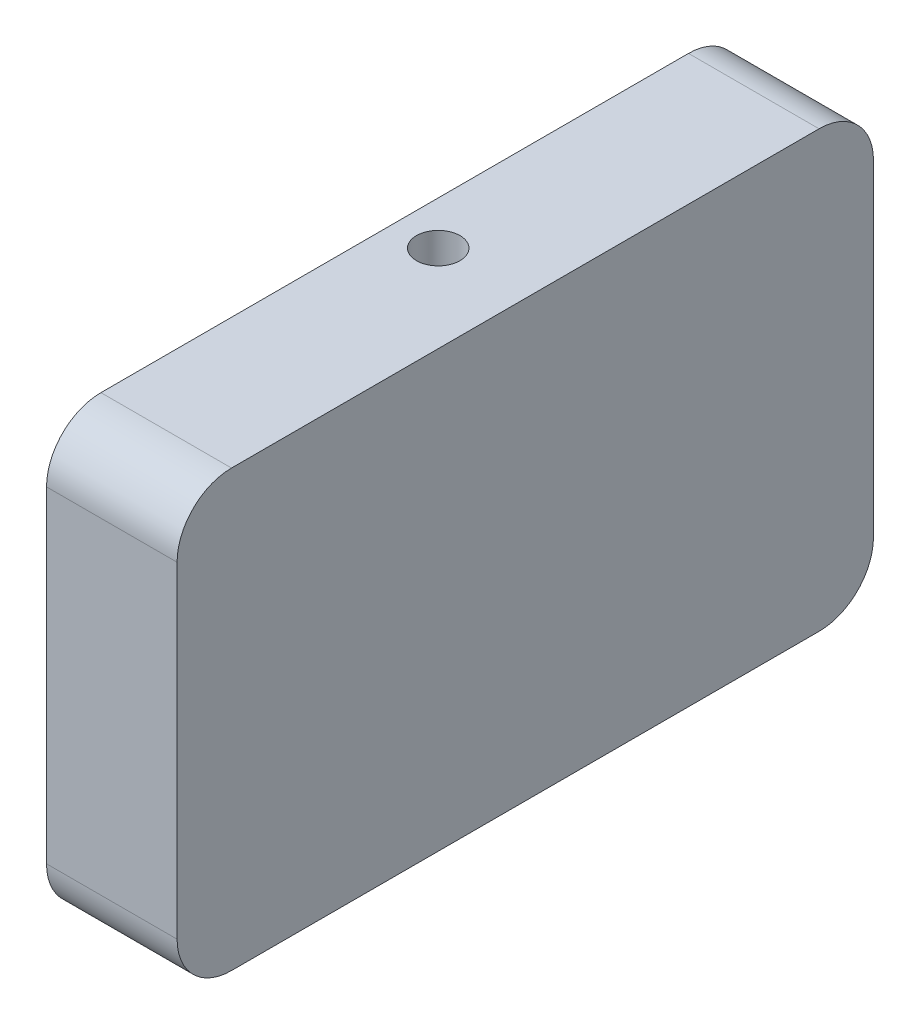
ISO-10303-21;
HEADER;
FILE_DESCRIPTION(('STEP AP214'),'2;1');
FILE_NAME('part.step','',(''),(''),'','','');
FILE_SCHEMA(('AUTOMOTIVE_DESIGN { 1 0 10303 214 1 1 1 1 }'));
ENDSEC;
DATA;
#1=APPLICATION_CONTEXT('core data for automotive mechanical design processes');
#2=APPLICATION_PROTOCOL_DEFINITION('international standard','automotive_design',2000,#1);
#3=PRODUCT_CONTEXT('',#1,'mechanical');
#4=PRODUCT('Part','Part','',(#3));
#5=PRODUCT_RELATED_PRODUCT_CATEGORY('part','',(#4));
#6=PRODUCT_DEFINITION_FORMATION('','',#4);
#7=PRODUCT_DEFINITION_CONTEXT('part definition',#1,'design');
#8=PRODUCT_DEFINITION('design','',#6,#7);
#9=PRODUCT_DEFINITION_SHAPE('','',#8);
#10=(LENGTH_UNIT() NAMED_UNIT(*) SI_UNIT(.MILLI.,.METRE.));
#11=(NAMED_UNIT(*) PLANE_ANGLE_UNIT() SI_UNIT($,.RADIAN.));
#12=(NAMED_UNIT(*) SI_UNIT($,.STERADIAN.) SOLID_ANGLE_UNIT());
#13=UNCERTAINTY_MEASURE_WITH_UNIT(LENGTH_MEASURE(1.E-05),#10,'distance_accuracy_value','');
#14=(GEOMETRIC_REPRESENTATION_CONTEXT(3) GLOBAL_UNCERTAINTY_ASSIGNED_CONTEXT((#13)) GLOBAL_UNIT_ASSIGNED_CONTEXT((#10,
#11,#12)) REPRESENTATION_CONTEXT('',''));
#15=CARTESIAN_POINT('',(0.,0.,0.));
#16=DIRECTION('',(0.,0.,1.));
#17=DIRECTION('',(1.,0.,0.));
#18=AXIS2_PLACEMENT_3D('',#15,#16,#17);
#19=CARTESIAN_POINT('',(12.,15.,-27.));
#20=DIRECTION('',(-1.,0.,0.));
#21=DIRECTION('',(0.,0.,1.));
#22=AXIS2_PLACEMENT_3D('',#19,#20,#21);
#23=CYLINDRICAL_SURFACE('',#22,5.00000000000001);
#24=CARTESIAN_POINT('',(0.,15.,-27.));
#25=DIRECTION('',(1.,0.,0.));
#26=DIRECTION('',(0.,0.,1.));
#27=AXIS2_PLACEMENT_3D('',#24,#25,#26);
#28=CIRCLE('',#27,5.00000000000001);
#29=CARTESIAN_POINT('',(0.,15.,-32.));
#30=VERTEX_POINT('',#29);
#31=CARTESIAN_POINT('',(0.,20.,-27.));
#32=VERTEX_POINT('',#31);
#33=EDGE_CURVE('E137',#30,#32,#28,.T.);
#34=ORIENTED_EDGE('',*,*,#33,.T.);
#35=DIRECTION('',(-1.,0.,0.));
#36=VECTOR('',#35,1.);
#37=CARTESIAN_POINT('',(12.,20.,-27.));
#38=LINE('',#37,#36);
#39=CARTESIAN_POINT('',(12.,20.,-27.));
#40=VERTEX_POINT('',#39);
#41=EDGE_CURVE('E11',#40,#32,#38,.T.);
#42=ORIENTED_EDGE('',*,*,#41,.F.);
#43=CARTESIAN_POINT('',(12.,15.,-27.));
#44=DIRECTION('',(1.,0.,0.));
#45=DIRECTION('',(0.,0.,1.));
#46=AXIS2_PLACEMENT_3D('',#43,#44,#45);
#47=CIRCLE('',#46,5.00000000000001);
#48=CARTESIAN_POINT('',(12.,15.,-32.));
#49=VERTEX_POINT('',#48);
#50=EDGE_CURVE('E152',#49,#40,#47,.T.);
#51=ORIENTED_EDGE('',*,*,#50,.F.);
#52=DIRECTION('',(-1.,0.,0.));
#53=VECTOR('',#52,1.);
#54=CARTESIAN_POINT('',(12.,15.,-32.));
#55=LINE('',#54,#53);
#56=EDGE_CURVE('E133',#49,#30,#55,.T.);
#57=ORIENTED_EDGE('',*,*,#56,.T.);
#58=EDGE_LOOP('',(#34,#42,#51,#57));
#59=FACE_BOUND('',#58,.T.);
#60=ADVANCED_FACE('F35',(#59),#23,.T.);
#61=CARTESIAN_POINT('',(12.,20.,27.));
#62=DIRECTION('',(0.,-1.,0.));
#63=DIRECTION('',(0.,0.,-1.));
#64=AXIS2_PLACEMENT_3D('',#61,#62,#63);
#65=PLANE('',#64);
#66=CARTESIAN_POINT('',(4.,20.,0.));
#67=DIRECTION('',(0.,-1.,0.));
#68=DIRECTION('',(0.,0.,-1.));
#69=AXIS2_PLACEMENT_3D('',#66,#67,#68);
#70=CIRCLE('',#69,2.);
#71=CARTESIAN_POINT('',(4.,20.,-2.));
#72=VERTEX_POINT('',#71);
#73=EDGE_CURVE('E167',#72,#72,#70,.T.);
#74=ORIENTED_EDGE('',*,*,#73,.T.);
#75=EDGE_LOOP('',(#74));
#76=FACE_BOUND('',#75,.T.);
#77=DIRECTION('',(0.,0.,1.));
#78=VECTOR('',#77,1.);
#79=CARTESIAN_POINT('',(0.,20.,27.));
#80=LINE('',#79,#78);
#81=CARTESIAN_POINT('',(0.,20.,27.));
#82=VERTEX_POINT('',#81);
#83=EDGE_CURVE('E140',#32,#82,#80,.T.);
#84=ORIENTED_EDGE('',*,*,#83,.T.);
#85=DIRECTION('',(-1.,0.,0.));
#86=VECTOR('',#85,1.);
#87=CARTESIAN_POINT('',(12.,20.,27.));
#88=LINE('',#87,#86);
#89=CARTESIAN_POINT('',(12.,20.,27.));
#90=VERTEX_POINT('',#89);
#91=EDGE_CURVE('E48',#90,#82,#88,.T.);
#92=ORIENTED_EDGE('',*,*,#91,.F.);
#93=DIRECTION('',(0.,0.,1.));
#94=VECTOR('',#93,1.);
#95=CARTESIAN_POINT('',(12.,20.,27.));
#96=LINE('',#95,#94);
#97=EDGE_CURVE('E100',#40,#90,#96,.T.);
#98=ORIENTED_EDGE('',*,*,#97,.F.);
#99=ORIENTED_EDGE('',*,*,#41,.T.);
#100=EDGE_LOOP('',(#84,#92,#98,#99));
#101=FACE_BOUND('',#100,.T.);
#102=ADVANCED_FACE('F190',(#76,#101),#65,.F.);
#103=CARTESIAN_POINT('',(12.,15.,27.));
#104=DIRECTION('',(-1.,0.,0.));
#105=DIRECTION('',(0.,0.,1.));
#106=AXIS2_PLACEMENT_3D('',#103,#104,#105);
#107=CYLINDRICAL_SURFACE('',#106,5.);
#108=CARTESIAN_POINT('',(0.,15.,27.));
#109=DIRECTION('',(1.,0.,0.));
#110=DIRECTION('',(0.,0.,1.));
#111=AXIS2_PLACEMENT_3D('',#108,#109,#110);
#112=CIRCLE('',#111,5.);
#113=CARTESIAN_POINT('',(0.,15.,32.));
#114=VERTEX_POINT('',#113);
#115=EDGE_CURVE('E143',#82,#114,#112,.T.);
#116=ORIENTED_EDGE('',*,*,#115,.T.);
#117=DIRECTION('',(-1.,0.,0.));
#118=VECTOR('',#117,1.);
#119=CARTESIAN_POINT('',(12.,15.,32.));
#120=LINE('',#119,#118);
#121=CARTESIAN_POINT('',(12.,15.,32.));
#122=VERTEX_POINT('',#121);
#123=EDGE_CURVE('E159',#122,#114,#120,.T.);
#124=ORIENTED_EDGE('',*,*,#123,.F.);
#125=CARTESIAN_POINT('',(12.,15.,27.));
#126=DIRECTION('',(1.,0.,0.));
#127=DIRECTION('',(0.,0.,1.));
#128=AXIS2_PLACEMENT_3D('',#125,#126,#127);
#129=CIRCLE('',#128,5.);
#130=EDGE_CURVE('E206',#90,#122,#129,.T.);
#131=ORIENTED_EDGE('',*,*,#130,.F.);
#132=ORIENTED_EDGE('',*,*,#91,.T.);
#133=EDGE_LOOP('',(#116,#124,#131,#132));
#134=FACE_BOUND('',#133,.T.);
#135=ADVANCED_FACE('F195',(#134),#107,.T.);
#136=CARTESIAN_POINT('',(12.,15.,32.));
#137=DIRECTION('',(0.,0.,-1.));
#138=DIRECTION('',(-1.,0.,0.));
#139=AXIS2_PLACEMENT_3D('',#136,#137,#138);
#140=PLANE('',#139);
#141=DIRECTION('',(0.,-1.,0.));
#142=VECTOR('',#141,1.);
#143=CARTESIAN_POINT('',(0.,15.,32.));
#144=LINE('',#143,#142);
#145=CARTESIAN_POINT('',(0.,-15.,32.));
#146=VERTEX_POINT('',#145);
#147=EDGE_CURVE('E145',#114,#146,#144,.T.);
#148=ORIENTED_EDGE('',*,*,#147,.T.);
#149=DIRECTION('',(-1.,0.,0.));
#150=VECTOR('',#149,1.);
#151=CARTESIAN_POINT('',(12.,-15.,32.));
#152=LINE('',#151,#150);
#153=CARTESIAN_POINT('',(12.,-15.,32.));
#154=VERTEX_POINT('',#153);
#155=EDGE_CURVE('E156',#154,#146,#152,.T.);
#156=ORIENTED_EDGE('',*,*,#155,.F.);
#157=DIRECTION('',(0.,-1.,0.));
#158=VECTOR('',#157,1.);
#159=CARTESIAN_POINT('',(12.,15.,32.));
#160=LINE('',#159,#158);
#161=EDGE_CURVE('E208',#122,#154,#160,.T.);
#162=ORIENTED_EDGE('',*,*,#161,.F.);
#163=ORIENTED_EDGE('',*,*,#123,.T.);
#164=EDGE_LOOP('',(#148,#156,#162,#163));
#165=FACE_BOUND('',#164,.T.);
#166=ADVANCED_FACE('F250',(#165),#140,.F.);
#167=CARTESIAN_POINT('',(12.,-15.,27.));
#168=DIRECTION('',(-1.,0.,0.));
#169=DIRECTION('',(0.,0.,1.));
#170=AXIS2_PLACEMENT_3D('',#167,#168,#169);
#171=CYLINDRICAL_SURFACE('',#170,5.);
#172=CARTESIAN_POINT('',(0.,-15.,27.));
#173=DIRECTION('',(1.,0.,0.));
#174=DIRECTION('',(0.,0.,1.));
#175=AXIS2_PLACEMENT_3D('',#172,#173,#174);
#176=CIRCLE('',#175,5.);
#177=CARTESIAN_POINT('',(0.,-20.,27.));
#178=VERTEX_POINT('',#177);
#179=EDGE_CURVE('E147',#146,#178,#176,.T.);
#180=ORIENTED_EDGE('',*,*,#179,.T.);
#181=DIRECTION('',(-1.,0.,0.));
#182=VECTOR('',#181,1.);
#183=CARTESIAN_POINT('',(12.,-20.,27.));
#184=LINE('',#183,#182);
#185=CARTESIAN_POINT('',(12.,-20.,27.));
#186=VERTEX_POINT('',#185);
#187=EDGE_CURVE('E128',#186,#178,#184,.T.);
#188=ORIENTED_EDGE('',*,*,#187,.F.);
#189=CARTESIAN_POINT('',(12.,-15.,27.));
#190=DIRECTION('',(1.,0.,0.));
#191=DIRECTION('',(0.,0.,1.));
#192=AXIS2_PLACEMENT_3D('',#189,#190,#191);
#193=CIRCLE('',#192,5.);
#194=EDGE_CURVE('E119',#154,#186,#193,.T.);
#195=ORIENTED_EDGE('',*,*,#194,.F.);
#196=ORIENTED_EDGE('',*,*,#155,.T.);
#197=EDGE_LOOP('',(#180,#188,#195,#196));
#198=FACE_BOUND('',#197,.T.);
#199=ADVANCED_FACE('F246',(#198),#171,.T.);
#200=CARTESIAN_POINT('',(12.,-20.,27.));
#201=DIRECTION('',(0.,1.,0.));
#202=DIRECTION('',(0.,0.,1.));
#203=AXIS2_PLACEMENT_3D('',#200,#201,#202);
#204=PLANE('',#203);
#205=CARTESIAN_POINT('',(4.,-20.,0.));
#206=DIRECTION('',(0.,-1.,0.));
#207=DIRECTION('',(0.,0.,-1.));
#208=AXIS2_PLACEMENT_3D('',#205,#206,#207);
#209=CIRCLE('',#208,2.);
#210=CARTESIAN_POINT('',(4.,-20.,-2.));
#211=VERTEX_POINT('',#210);
#212=EDGE_CURVE('E218',#211,#211,#209,.T.);
#213=ORIENTED_EDGE('',*,*,#212,.F.);
#214=EDGE_LOOP('',(#213));
#215=FACE_BOUND('',#214,.T.);
#216=DIRECTION('',(0.,0.,-1.));
#217=VECTOR('',#216,1.);
#218=CARTESIAN_POINT('',(0.,-20.,27.));
#219=LINE('',#218,#217);
#220=CARTESIAN_POINT('',(0.,-20.,-27.));
#221=VERTEX_POINT('',#220);
#222=EDGE_CURVE('E127',#178,#221,#219,.T.);
#223=ORIENTED_EDGE('',*,*,#222,.T.);
#224=DIRECTION('',(-1.,0.,0.));
#225=VECTOR('',#224,1.);
#226=CARTESIAN_POINT('',(12.,-20.,-27.));
#227=LINE('',#226,#225);
#228=CARTESIAN_POINT('',(12.,-20.,-27.));
#229=VERTEX_POINT('',#228);
#230=EDGE_CURVE('E124',#229,#221,#227,.T.);
#231=ORIENTED_EDGE('',*,*,#230,.F.);
#232=DIRECTION('',(0.,0.,-1.));
#233=VECTOR('',#232,1.);
#234=CARTESIAN_POINT('',(12.,-20.,27.));
#235=LINE('',#234,#233);
#236=EDGE_CURVE('E113',#186,#229,#235,.T.);
#237=ORIENTED_EDGE('',*,*,#236,.F.);
#238=ORIENTED_EDGE('',*,*,#187,.T.);
#239=EDGE_LOOP('',(#223,#231,#237,#238));
#240=FACE_BOUND('',#239,.T.);
#241=ADVANCED_FACE('F125',(#215,#240),#204,.F.);
#242=CARTESIAN_POINT('',(12.,-15.,-27.));
#243=DIRECTION('',(-1.,0.,0.));
#244=DIRECTION('',(0.,0.,1.));
#245=AXIS2_PLACEMENT_3D('',#242,#243,#244);
#246=CYLINDRICAL_SURFACE('',#245,5.00000000000001);
#247=CARTESIAN_POINT('',(0.,-15.,-27.));
#248=DIRECTION('',(1.,0.,0.));
#249=DIRECTION('',(0.,0.,-1.));
#250=AXIS2_PLACEMENT_3D('',#247,#248,#249);
#251=CIRCLE('',#250,5.00000000000001);
#252=CARTESIAN_POINT('',(0.,-15.,-32.));
#253=VERTEX_POINT('',#252);
#254=EDGE_CURVE('E86',#221,#253,#251,.T.);
#255=ORIENTED_EDGE('',*,*,#254,.T.);
#256=DIRECTION('',(-1.,0.,0.));
#257=VECTOR('',#256,1.);
#258=CARTESIAN_POINT('',(12.,-15.,-32.));
#259=LINE('',#258,#257);
#260=CARTESIAN_POINT('',(12.,-15.,-32.));
#261=VERTEX_POINT('',#260);
#262=EDGE_CURVE('E129',#261,#253,#259,.T.);
#263=ORIENTED_EDGE('',*,*,#262,.F.);
#264=CARTESIAN_POINT('',(12.,-15.,-27.));
#265=DIRECTION('',(1.,0.,0.));
#266=DIRECTION('',(0.,0.,-1.));
#267=AXIS2_PLACEMENT_3D('',#264,#265,#266);
#268=CIRCLE('',#267,5.00000000000001);
#269=EDGE_CURVE('E117',#229,#261,#268,.T.);
#270=ORIENTED_EDGE('',*,*,#269,.F.);
#271=ORIENTED_EDGE('',*,*,#230,.T.);
#272=EDGE_LOOP('',(#255,#263,#270,#271));
#273=FACE_BOUND('',#272,.T.);
#274=ADVANCED_FACE('F131',(#273),#246,.T.);
#275=CARTESIAN_POINT('',(12.,15.,-32.));
#276=DIRECTION('',(0.,0.,1.));
#277=DIRECTION('',(0.,-1.,0.));
#278=AXIS2_PLACEMENT_3D('',#275,#276,#277);
#279=PLANE('',#278);
#280=DIRECTION('',(0.,1.,0.));
#281=VECTOR('',#280,1.);
#282=CARTESIAN_POINT('',(0.,15.,-32.));
#283=LINE('',#282,#281);
#284=EDGE_CURVE('E92',#253,#30,#283,.T.);
#285=ORIENTED_EDGE('',*,*,#284,.T.);
#286=ORIENTED_EDGE('',*,*,#56,.F.);
#287=DIRECTION('',(0.,1.,0.));
#288=VECTOR('',#287,1.);
#289=CARTESIAN_POINT('',(12.,15.,-32.));
#290=LINE('',#289,#288);
#291=EDGE_CURVE('E57',#261,#49,#290,.T.);
#292=ORIENTED_EDGE('',*,*,#291,.F.);
#293=ORIENTED_EDGE('',*,*,#262,.T.);
#294=EDGE_LOOP('',(#285,#286,#292,#293));
#295=FACE_BOUND('',#294,.T.);
#296=ADVANCED_FACE('F238',(#295),#279,.F.);
#297=CARTESIAN_POINT('',(12.,15.,-27.));
#298=DIRECTION('',(-1.,0.,0.));
#299=DIRECTION('',(0.,0.,1.));
#300=AXIS2_PLACEMENT_3D('',#297,#298,#299);
#301=PLANE('',#300);
#302=ORIENTED_EDGE('',*,*,#50,.T.);
#303=ORIENTED_EDGE('',*,*,#97,.T.);
#304=ORIENTED_EDGE('',*,*,#130,.T.);
#305=ORIENTED_EDGE('',*,*,#161,.T.);
#306=ORIENTED_EDGE('',*,*,#194,.T.);
#307=ORIENTED_EDGE('',*,*,#236,.T.);
#308=ORIENTED_EDGE('',*,*,#269,.T.);
#309=ORIENTED_EDGE('',*,*,#291,.T.);
#310=EDGE_LOOP('',(#302,#303,#304,#305,#306,#307,#308,#309));
#311=FACE_BOUND('',#310,.T.);
#312=ADVANCED_FACE('F115',(#311),#301,.F.);
#313=CARTESIAN_POINT('',(0.,15.,-27.));
#314=DIRECTION('',(-1.,0.,0.));
#315=DIRECTION('',(0.,0.,1.));
#316=AXIS2_PLACEMENT_3D('',#313,#314,#315);
#317=PLANE('',#316);
#318=CARTESIAN_POINT('',(0.,0.,0.));
#319=DIRECTION('',(-1.,0.,0.));
#320=DIRECTION('',(0.,0.,1.));
#321=AXIS2_PLACEMENT_3D('',#318,#319,#320);
#322=CIRCLE('',#321,7.);
#323=CARTESIAN_POINT('',(0.,0.,7.));
#324=VERTEX_POINT('',#323);
#325=EDGE_CURVE('E214',#324,#324,#322,.T.);
#326=ORIENTED_EDGE('',*,*,#325,.F.);
#327=EDGE_LOOP('',(#326));
#328=FACE_BOUND('',#327,.T.);
#329=ORIENTED_EDGE('',*,*,#33,.F.);
#330=ORIENTED_EDGE('',*,*,#284,.F.);
#331=ORIENTED_EDGE('',*,*,#254,.F.);
#332=ORIENTED_EDGE('',*,*,#222,.F.);
#333=ORIENTED_EDGE('',*,*,#179,.F.);
#334=ORIENTED_EDGE('',*,*,#147,.F.);
#335=ORIENTED_EDGE('',*,*,#115,.F.);
#336=ORIENTED_EDGE('',*,*,#83,.F.);
#337=EDGE_LOOP('',(#329,#330,#331,#332,#333,#334,#335,#336));
#338=FACE_BOUND('',#337,.T.);
#339=ADVANCED_FACE('F186',(#328,#338),#317,.T.);
#340=CARTESIAN_POINT('',(8.,0.,0.));
#341=DIRECTION('',(-1.,0.,0.));
#342=DIRECTION('',(0.,0.,1.));
#343=AXIS2_PLACEMENT_3D('',#340,#341,#342);
#344=CYLINDRICAL_SURFACE('',#343,7.);
#345=CARTESIAN_POINT('',(4.,6.70820393249937,-2.));
#346=CARTESIAN_POINT('',(3.89014846212276,6.70820547009708,-1.99999802046393));
#347=CARTESIAN_POINT('',(3.78027691574549,6.71093179679208,-1.9909186659955));
#348=CARTESIAN_POINT('',(3.56372876113703,6.72150389207102,-1.95492363390195));
#349=CARTESIAN_POINT('',(3.45705347089938,6.72935174296489,-1.92800070136334));
#350=CARTESIAN_POINT('',(3.2500627991285,6.74920709521546,-1.85729343292866));
#351=CARTESIAN_POINT('',(3.14973784818287,6.76120815257369,-1.81353520651874));
#352=CARTESIAN_POINT('',(2.95783218844563,6.78800921096146,-1.71048364062938));
#353=CARTESIAN_POINT('',(2.86625251962197,6.80280954425194,-1.65118845666347));
#354=CARTESIAN_POINT('',(2.69180843468517,6.83401783214154,-1.51692480098199));
#355=CARTESIAN_POINT('',(2.60923219787079,6.8504575596415,-1.4415892111325));
#356=CARTESIAN_POINT('',(2.45769721669621,6.88281965512018,-1.27817124546927));
#357=CARTESIAN_POINT('',(2.38874006687716,6.89874196233652,-1.19008737915963));
#358=CARTESIAN_POINT('',(2.26517135164649,6.92863332001512,-1.00164603215759));
#359=CARTESIAN_POINT('',(2.21085038024902,6.94256054500866,-0.901090783761867));
#360=CARTESIAN_POINT('',(2.11999822558403,6.96652540485531,-0.691808475239639));
#361=CARTESIAN_POINT('',(2.08346357875974,6.97656379690866,-0.583083010875172));
#362=CARTESIAN_POINT('',(2.03016553876029,6.99139519300236,-0.363558575121177));
#363=CARTESIAN_POINT('',(2.01291097829533,6.99631827011303,-0.25288779812904));
#364=CARTESIAN_POINT('',(1.99711326611677,7.00082095659694,-0.0301201024219236));
#365=CARTESIAN_POINT('',(1.99856653766265,7.00040158738982,0.0819765395885486));
#366=CARTESIAN_POINT('',(2.01980637491803,6.99436006763307,0.300980195735221));
#367=CARTESIAN_POINT('',(2.03906161263799,6.98888870776051,0.407943546108946));
#368=CARTESIAN_POINT('',(2.09449510246438,6.97353886330137,0.617052222177618));
#369=CARTESIAN_POINT('',(2.13067438426212,6.96366011056224,0.719197254300509));
#370=CARTESIAN_POINT('',(2.21930940081182,6.94039031772111,0.917073833728924));
#371=CARTESIAN_POINT('',(2.27193877780834,6.92696205512133,1.01272304385077));
#372=CARTESIAN_POINT('',(2.39184458639803,6.89802768974041,1.19400724359048));
#373=CARTESIAN_POINT('',(2.45912422766648,6.8825211319195,1.27964003241601));
#374=CARTESIAN_POINT('',(2.60920571061859,6.85045683019623,1.44163264854775));
#375=CARTESIAN_POINT('',(2.69246943360505,6.83388129369387,1.51756157758489));
#376=CARTESIAN_POINT('',(2.87071509184596,6.80202973786992,1.65449301574976));
#377=CARTESIAN_POINT('',(2.96569797694901,6.78675382405366,1.71549431378261));
#378=CARTESIAN_POINT('',(3.16573088449799,6.75915174814409,1.82123335985447));
#379=CARTESIAN_POINT('',(3.27085522505166,6.74685010938643,1.86583737788771));
#380=CARTESIAN_POINT('',(3.48755316350462,6.72688544387341,1.9365895149609));
#381=CARTESIAN_POINT('',(3.59912487465992,6.71922106753542,1.9627430040271));
#382=CARTESIAN_POINT('',(3.82148042433232,6.70969115196194,1.99507417199885));
#383=CARTESIAN_POINT('',(3.93216181693302,6.70763711316669,2.00190148157354));
#384=CARTESIAN_POINT('',(4.15308831592097,6.7090415959684,1.99718996719665));
#385=CARTESIAN_POINT('',(4.26333347501093,6.71249942992568,1.98565343424642));
#386=CARTESIAN_POINT('',(4.47764122802296,6.72435430053723,1.94511781425928));
#387=CARTESIAN_POINT('',(4.58178758601516,6.73263642965451,1.9165246218414));
#388=CARTESIAN_POINT('',(4.78380187199774,6.75309063930731,1.84315161866429));
#389=CARTESIAN_POINT('',(4.88166889164565,6.7652632811114,1.79836947226768));
#390=CARTESIAN_POINT('',(5.07102207521675,6.79250188009389,1.69261965121623));
#391=CARTESIAN_POINT('',(5.1622904442022,6.80763197381122,1.63127891729131));
#392=CARTESIAN_POINT('',(5.33347637344336,6.83893726549831,1.49460463684841));
#393=CARTESIAN_POINT('',(5.41339146701214,6.85511268947611,1.41926805768137));
#394=CARTESIAN_POINT('',(5.56237941828819,6.88734727436087,1.25370800996556));
#395=CARTESIAN_POINT('',(5.63099497141874,6.90338406046143,1.16306771024055));
#396=CARTESIAN_POINT('',(5.75204568138274,6.93297977045999,0.971185307057544));
#397=CARTESIAN_POINT('',(5.80448168392238,6.94653882385412,0.869943758098182));
#398=CARTESIAN_POINT('',(5.89118428702633,6.96956504846406,0.660433272956165));
#399=CARTESIAN_POINT('',(5.92558838958616,6.97906308127247,0.552224799899635));
#400=CARTESIAN_POINT('',(5.97562680194018,6.99303339623885,0.331245648549923));
#401=CARTESIAN_POINT('',(5.99126594018132,6.99750697123019,0.218476151585437));
#402=CARTESIAN_POINT('',(6.00299143399779,7.00085335003284,-0.00417823795903063));
#403=CARTESIAN_POINT('',(5.99974414908282,6.99991703588995,-0.114025631049958));
#404=CARTESIAN_POINT('',(5.97536171858972,6.99299069122135,-0.331545172422006));
#405=CARTESIAN_POINT('',(5.95422742961796,6.98700090270593,-0.439217424617533));
#406=CARTESIAN_POINT('',(5.89506863902115,6.97068801860116,-0.648404133039588));
#407=CARTESIAN_POINT('',(5.85719682105603,6.96040414048174,-0.749965033435051));
#408=CARTESIAN_POINT('',(5.76577384171452,6.93657094143453,-0.945347202761463));
#409=CARTESIAN_POINT('',(5.71222025290775,6.92302111501784,-1.03916727058068));
#410=CARTESIAN_POINT('',(5.58910266257519,6.89358955440188,-1.21943345635391));
#411=CARTESIAN_POINT('',(5.5191099132116,6.8776504578623,-1.30557732800707));
#412=CARTESIAN_POINT('',(5.36589087454606,6.84544064986529,-1.46512122231839));
#413=CARTESIAN_POINT('',(5.28266092891517,6.82916984787116,-1.53851771218981));
#414=CARTESIAN_POINT('',(5.10270308300454,6.79764037543869,-1.67240846029126));
#415=CARTESIAN_POINT('',(5.00567805249652,6.78241951768489,-1.73251316723594));
#416=CARTESIAN_POINT('',(4.80247813468537,6.7552844533164,-1.83547943619619));
#417=CARTESIAN_POINT('',(4.69630840891167,6.74336839719835,-1.8783506488486));
#418=CARTESIAN_POINT('',(4.49234629976735,6.72558459556592,-1.94098534012467));
#419=CARTESIAN_POINT('',(4.39530965189748,6.71912438833989,-1.96305899981724));
#420=CARTESIAN_POINT('',(4.19885388164808,6.71043369466525,-1.99256607043695));
#421=CARTESIAN_POINT('',(4.0994351377689,6.70820254070055,-2.00000179183146));
#422=CARTESIAN_POINT('',(4.,6.70820393249937,-2.));
#423=B_SPLINE_CURVE_WITH_KNOTS('',3,(#345,#346,#347,#348,#349,#350,#351,#352,#353,#354,#355,
#356,#357,#358,#359,#360,#361,#362,#363,#364,#365,#366,#367,#368,#369,#370,#371,#372,#373,#374,
#375,#376,#377,#378,#379,#380,#381,#382,#383,#384,#385,#386,#387,#388,#389,#390,#391,#392,#393,
#394,#395,#396,#397,#398,#399,#400,#401,#402,#403,#404,#405,#406,#407,#408,#409,#410,#411,#412,
#413,#414,#415,#416,#417,#418,#419,#420,#421,#422),.UNSPECIFIED.,.T.,.F.,(4,2,2,2,2,2,2,2,2,2,2,
2,2,2,2,2,2,2,2,2,2,2,2,2,2,2,2,2,2,2,2,2,2,2,2,2,2,2,4),(0.,0.32918834236395,0.658510609618863,
0.987324183736438,1.31617681100735,1.65357167206616,1.99100601238483,2.33471483013846,
2.67835669017706,3.01302901028742,3.34763734552418,3.67257037643421,3.99752317946522,
4.32602903378491,4.65460693184835,4.99471612693,5.3348529062976,5.67770520630006,
6.02045767793012,6.35154363333481,6.68258828698449,7.00605289656511,7.32956419216041,
7.66108006042382,7.99266784620105,8.33545388376657,8.67822200084647,9.01833685298089,
9.35836417076638,9.6864689768406,10.0145580709057,10.3397141238921,10.6649205354322,
10.9997976874537,11.3347674991531,11.6785361242131,12.0221119721565,12.3201328886649,
12.61810676147),.UNSPECIFIED.);
#424=CARTESIAN_POINT('',(4.,6.70820393249937,-2.));
#425=VERTEX_POINT('',#424);
#426=EDGE_CURVE('E38',#425,#425,#423,.T.);
#427=ORIENTED_EDGE('',*,*,#426,.T.);
#428=EDGE_LOOP('',(#427));
#429=FACE_BOUND('',#428,.T.);
#430=CARTESIAN_POINT('',(4.,-6.70820393249937,-2.));
#431=CARTESIAN_POINT('',(4.10985153787724,-6.70820547009708,-1.99999802046393));
#432=CARTESIAN_POINT('',(4.21972308425451,-6.71093179679208,-1.9909186659955));
#433=CARTESIAN_POINT('',(4.43627123886298,-6.72150389207102,-1.95492363390195));
#434=CARTESIAN_POINT('',(4.54294652910063,-6.72935174296489,-1.92800070136334));
#435=CARTESIAN_POINT('',(4.7499372008715,-6.74920709521546,-1.85729343292866));
#436=CARTESIAN_POINT('',(4.85026215181714,-6.76120815257369,-1.81353520651874));
#437=CARTESIAN_POINT('',(5.04216781155437,-6.78800921096146,-1.71048364062938));
#438=CARTESIAN_POINT('',(5.13374748037804,-6.80280954425194,-1.65118845666347));
#439=CARTESIAN_POINT('',(5.30819156531484,-6.83401783214154,-1.51692480098199));
#440=CARTESIAN_POINT('',(5.39076780212922,-6.8504575596415,-1.4415892111325));
#441=CARTESIAN_POINT('',(5.5423027833038,-6.88281965512018,-1.27817124546927));
#442=CARTESIAN_POINT('',(5.61125993312284,-6.89874196233652,-1.19008737915963));
#443=CARTESIAN_POINT('',(5.73482864835352,-6.92863332001512,-1.00164603215759));
#444=CARTESIAN_POINT('',(5.78914961975098,-6.94256054500866,-0.901090783761867));
#445=CARTESIAN_POINT('',(5.88000177441597,-6.96652540485531,-0.691808475239639));
#446=CARTESIAN_POINT('',(5.91653642124027,-6.97656379690866,-0.583083010875172));
#447=CARTESIAN_POINT('',(5.96983446123972,-6.99139519300235,-0.363558575121177));
#448=CARTESIAN_POINT('',(5.98708902170468,-6.99631827011303,-0.25288779812904));
#449=CARTESIAN_POINT('',(6.00288673388324,-7.00082095659694,-0.0301201024219234));
#450=CARTESIAN_POINT('',(6.00143346233736,-7.00040158738982,0.0819765395885488));
#451=CARTESIAN_POINT('',(5.98019362508198,-6.99436006763307,0.300980195735221));
#452=CARTESIAN_POINT('',(5.96093838736202,-6.98888870776051,0.407943546108946));
#453=CARTESIAN_POINT('',(5.90550489753563,-6.97353886330137,0.617052222177617));
#454=CARTESIAN_POINT('',(5.86932561573788,-6.96366011056224,0.719197254300509));
#455=CARTESIAN_POINT('',(5.78069059918819,-6.94039031772111,0.917073833728924));
#456=CARTESIAN_POINT('',(5.72806122219167,-6.92696205512133,1.01272304385077));
#457=CARTESIAN_POINT('',(5.60815541360198,-6.89802768974041,1.19400724359048));
#458=CARTESIAN_POINT('',(5.54087577233353,-6.8825211319195,1.27964003241601));
#459=CARTESIAN_POINT('',(5.39079428938142,-6.85045683019623,1.44163264854775));
#460=CARTESIAN_POINT('',(5.30753056639496,-6.83388129369387,1.51756157758489));
#461=CARTESIAN_POINT('',(5.12928490815405,-6.80202973786992,1.65449301574976));
#462=CARTESIAN_POINT('',(5.034302023051,-6.78675382405366,1.71549431378261));
#463=CARTESIAN_POINT('',(4.83426911550201,-6.75915174814409,1.82123335985447));
#464=CARTESIAN_POINT('',(4.72914477494835,-6.74685010938643,1.86583737788771));
#465=CARTESIAN_POINT('',(4.51244683649538,-6.72688544387341,1.9365895149609));
#466=CARTESIAN_POINT('',(4.40087512534009,-6.71922106753542,1.9627430040271));
#467=CARTESIAN_POINT('',(4.17851957566769,-6.70969115196194,1.99507417199885));
#468=CARTESIAN_POINT('',(4.06783818306698,-6.70763711316669,2.00190148157354));
#469=CARTESIAN_POINT('',(3.84691168407904,-6.7090415959684,1.99718996719665));
#470=CARTESIAN_POINT('',(3.73666652498908,-6.71249942992568,1.98565343424642));
#471=CARTESIAN_POINT('',(3.52235877197705,-6.72435430053723,1.94511781425928));
#472=CARTESIAN_POINT('',(3.41821241398484,-6.73263642965451,1.9165246218414));
#473=CARTESIAN_POINT('',(3.21619812800227,-6.75309063930731,1.84315161866429));
#474=CARTESIAN_POINT('',(3.11833110835435,-6.7652632811114,1.79836947226768));
#475=CARTESIAN_POINT('',(2.92897792478326,-6.79250188009389,1.69261965121623));
#476=CARTESIAN_POINT('',(2.83770955579781,-6.80763197381122,1.63127891729131));
#477=CARTESIAN_POINT('',(2.66652362655664,-6.83893726549831,1.49460463684841));
#478=CARTESIAN_POINT('',(2.58660853298787,-6.85511268947611,1.41926805768137));
#479=CARTESIAN_POINT('',(2.43762058171182,-6.88734727436087,1.25370800996555));
#480=CARTESIAN_POINT('',(2.36900502858127,-6.90338406046143,1.16306771024055));
#481=CARTESIAN_POINT('',(2.24795431861727,-6.93297977045999,0.971185307057544));
#482=CARTESIAN_POINT('',(2.19551831607762,-6.94653882385412,0.869943758098182));
#483=CARTESIAN_POINT('',(2.10881571297367,-6.96956504846406,0.660433272956165));
#484=CARTESIAN_POINT('',(2.07441161041385,-6.97906308127247,0.552224799899634));
#485=CARTESIAN_POINT('',(2.02437319805982,-6.99303339623885,0.331245648549921));
#486=CARTESIAN_POINT('',(2.00873405981869,-6.99750697123019,0.218476151585436));
#487=CARTESIAN_POINT('',(1.99700856600221,-7.00085335003284,-0.00417823795903075));
#488=CARTESIAN_POINT('',(2.00025585091718,-6.99991703588995,-0.114025631049958));
#489=CARTESIAN_POINT('',(2.02463828141029,-6.99299069122135,-0.331545172422005));
#490=CARTESIAN_POINT('',(2.04577257038204,-6.98700090270593,-0.439217424617533));
#491=CARTESIAN_POINT('',(2.10493136097885,-6.97068801860116,-0.648404133039589));
#492=CARTESIAN_POINT('',(2.14280317894398,-6.96040414048174,-0.749965033435051));
#493=CARTESIAN_POINT('',(2.23422615828548,-6.93657094143453,-0.945347202761463));
#494=CARTESIAN_POINT('',(2.28777974709226,-6.92302111501784,-1.03916727058068));
#495=CARTESIAN_POINT('',(2.41089733742482,-6.89358955440188,-1.21943345635391));
#496=CARTESIAN_POINT('',(2.48089008678841,-6.8776504578623,-1.30557732800707));
#497=CARTESIAN_POINT('',(2.63410912545395,-6.84544064986529,-1.46512122231839));
#498=CARTESIAN_POINT('',(2.71733907108484,-6.82916984787116,-1.53851771218981));
#499=CARTESIAN_POINT('',(2.89729691699546,-6.79764037543869,-1.67240846029126));
#500=CARTESIAN_POINT('',(2.99432194750349,-6.78241951768489,-1.73251316723594));
#501=CARTESIAN_POINT('',(3.19752186531464,-6.7552844533164,-1.83547943619619));
#502=CARTESIAN_POINT('',(3.30369159108834,-6.74336839719835,-1.8783506488486));
#503=CARTESIAN_POINT('',(3.50765370023266,-6.72558459556592,-1.94098534012467));
#504=CARTESIAN_POINT('',(3.60469034810253,-6.71912438833989,-1.96305899981724));
#505=CARTESIAN_POINT('',(3.80114611835192,-6.71043369466525,-1.99256607043695));
#506=CARTESIAN_POINT('',(3.9005648622311,-6.70820254070055,-2.00000179183146));
#507=CARTESIAN_POINT('',(4.,-6.70820393249937,-2.));
#508=B_SPLINE_CURVE_WITH_KNOTS('',3,(#430,#431,#432,#433,#434,#435,#436,#437,#438,#439,#440,
#441,#442,#443,#444,#445,#446,#447,#448,#449,#450,#451,#452,#453,#454,#455,#456,#457,#458,#459,
#460,#461,#462,#463,#464,#465,#466,#467,#468,#469,#470,#471,#472,#473,#474,#475,#476,#477,#478,
#479,#480,#481,#482,#483,#484,#485,#486,#487,#488,#489,#490,#491,#492,#493,#494,#495,#496,#497,
#498,#499,#500,#501,#502,#503,#504,#505,#506,#507),.UNSPECIFIED.,.T.,.F.,(4,2,2,2,2,2,2,2,2,2,2,
2,2,2,2,2,2,2,2,2,2,2,2,2,2,2,2,2,2,2,2,2,2,2,2,2,2,2,4),(0.,0.32918834236395,0.658510609618863,
0.987324183736438,1.31617681100735,1.65357167206616,1.99100601238483,2.33471483013846,
2.67835669017706,3.01302901028742,3.34763734552418,3.67257037643422,3.99752317946522,
4.32602903378491,4.65460693184835,4.99471612693,5.3348529062976,5.67770520630006,
6.02045767793012,6.35154363333481,6.6825882869845,7.00605289656512,7.32956419216041,
7.66108006042382,7.99266784620105,8.33545388376657,8.67822200084648,9.0183368529809,
9.35836417076639,9.68646897684061,10.0145580709057,10.3397141238921,10.6649205354322,
10.9997976874537,11.3347674991531,11.6785361242131,12.0221119721565,12.3201328886649,
12.61810676147),.UNSPECIFIED.);
#509=CARTESIAN_POINT('',(4.,-6.70820393249937,-2.));
#510=VERTEX_POINT('',#509);
#511=EDGE_CURVE('E163',#510,#510,#508,.T.);
#512=ORIENTED_EDGE('',*,*,#511,.T.);
#513=EDGE_LOOP('',(#512));
#514=FACE_BOUND('',#513,.T.);
#515=CARTESIAN_POINT('',(8.,0.,0.));
#516=DIRECTION('',(-1.,0.,0.));
#517=DIRECTION('',(0.,0.,1.));
#518=AXIS2_PLACEMENT_3D('',#515,#516,#517);
#519=CIRCLE('',#518,7.);
#520=CARTESIAN_POINT('',(8.,0.,7.));
#521=VERTEX_POINT('',#520);
#522=EDGE_CURVE('E141',#521,#521,#519,.T.);
#523=ORIENTED_EDGE('',*,*,#522,.F.);
#524=EDGE_LOOP('',(#523));
#525=FACE_BOUND('',#524,.T.);
#526=ORIENTED_EDGE('',*,*,#325,.T.);
#527=EDGE_LOOP('',(#526));
#528=FACE_BOUND('',#527,.T.);
#529=ADVANCED_FACE('F168',(#429,#514,#525,#528),#344,.F.);
#530=CARTESIAN_POINT('',(8.,0.,0.));
#531=DIRECTION('',(-1.,0.,0.));
#532=DIRECTION('',(0.,0.,1.));
#533=AXIS2_PLACEMENT_3D('',#530,#531,#532);
#534=PLANE('',#533);
#535=ORIENTED_EDGE('',*,*,#522,.T.);
#536=EDGE_LOOP('',(#535));
#537=FACE_BOUND('',#536,.T.);
#538=ADVANCED_FACE('F177',(#537),#534,.T.);
#539=CARTESIAN_POINT('',(4.,20.,0.));
#540=DIRECTION('',(0.,-1.,0.));
#541=DIRECTION('',(0.,0.,-1.));
#542=AXIS2_PLACEMENT_3D('',#539,#540,#541);
#543=CYLINDRICAL_SURFACE('',#542,2.);
#544=ORIENTED_EDGE('',*,*,#212,.T.);
#545=EDGE_LOOP('',(#544));
#546=FACE_BOUND('',#545,.T.);
#547=ORIENTED_EDGE('',*,*,#511,.F.);
#548=EDGE_LOOP('',(#547));
#549=FACE_BOUND('',#548,.T.);
#550=ADVANCED_FACE('F175',(#546,#549),#543,.F.);
#551=ORIENTED_EDGE('',*,*,#73,.F.);
#552=EDGE_LOOP('',(#551));
#553=FACE_BOUND('',#552,.T.);
#554=ORIENTED_EDGE('',*,*,#426,.F.);
#555=EDGE_LOOP('',(#554));
#556=FACE_BOUND('',#555,.T.);
#557=ADVANCED_FACE('F172',(#553,#556),#543,.F.);
#558=CLOSED_SHELL('',(#60,#102,#135,#166,#199,#241,#274,#296,#312,#339,#529,#538,#550,#557));
#559=MANIFOLD_SOLID_BREP('B2',#558);
#560=ADVANCED_BREP_SHAPE_REPRESENTATION('',(#18,#559),#14);
#561=SHAPE_DEFINITION_REPRESENTATION(#9,#560);
ENDSEC;
END-ISO-10303-21;
